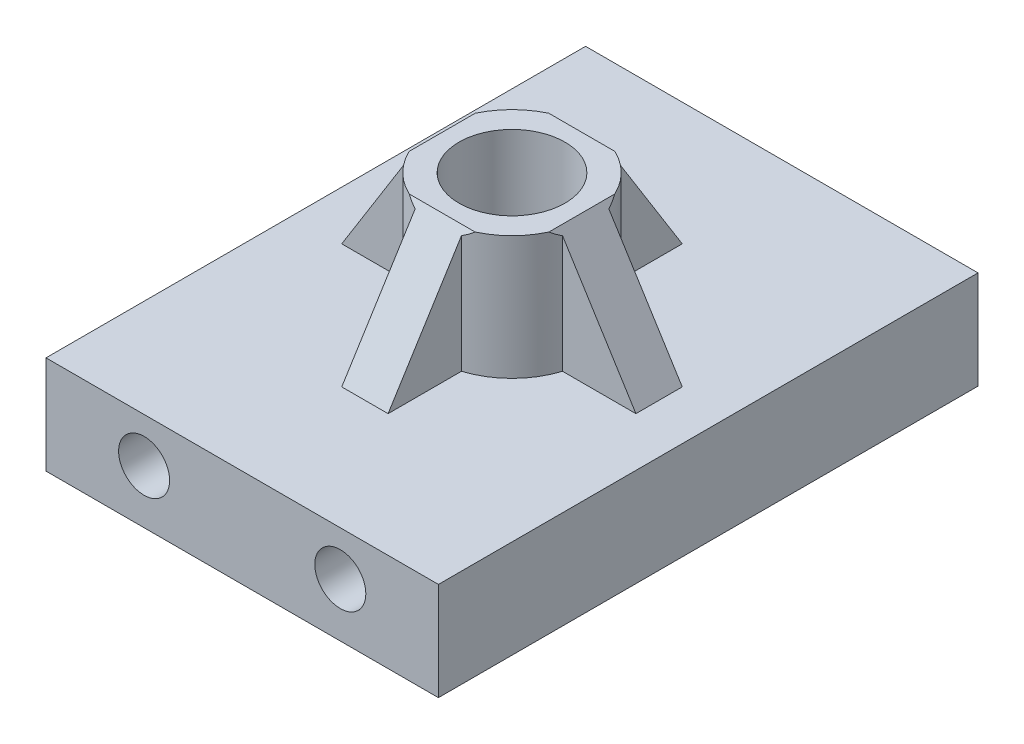
ISO-10303-21;
HEADER;
FILE_DESCRIPTION(('STEP AP214'),'2;1');
FILE_NAME('part.step','',(''),(''),'','','');
FILE_SCHEMA(('AUTOMOTIVE_DESIGN { 1 0 10303 214 1 1 1 1 }'));
ENDSEC;
DATA;
#1=APPLICATION_CONTEXT('core data for automotive mechanical design processes');
#2=APPLICATION_PROTOCOL_DEFINITION('international standard','automotive_design',2000,#1);
#3=PRODUCT_CONTEXT('',#1,'mechanical');
#4=PRODUCT('Part','Part','',(#3));
#5=PRODUCT_RELATED_PRODUCT_CATEGORY('part','',(#4));
#6=PRODUCT_DEFINITION_FORMATION('','',#4);
#7=PRODUCT_DEFINITION_CONTEXT('part definition',#1,'design');
#8=PRODUCT_DEFINITION('design','',#6,#7);
#9=PRODUCT_DEFINITION_SHAPE('','',#8);
#10=(LENGTH_UNIT() NAMED_UNIT(*) SI_UNIT(.MILLI.,.METRE.));
#11=(NAMED_UNIT(*) PLANE_ANGLE_UNIT() SI_UNIT($,.RADIAN.));
#12=(NAMED_UNIT(*) SI_UNIT($,.STERADIAN.) SOLID_ANGLE_UNIT());
#13=UNCERTAINTY_MEASURE_WITH_UNIT(LENGTH_MEASURE(1.E-05),#10,'distance_accuracy_value','');
#14=(GEOMETRIC_REPRESENTATION_CONTEXT(3) GLOBAL_UNCERTAINTY_ASSIGNED_CONTEXT((#13)) GLOBAL_UNIT_ASSIGNED_CONTEXT((#10,
#11,#12)) REPRESENTATION_CONTEXT('',''));
#15=CARTESIAN_POINT('',(0.,0.,0.));
#16=DIRECTION('',(0.,0.,1.));
#17=DIRECTION('',(1.,0.,0.));
#18=AXIS2_PLACEMENT_3D('',#15,#16,#17);
#19=CARTESIAN_POINT('',(0.,6.35,34.925));
#20=DIRECTION('',(0.,-1.,0.));
#21=DIRECTION('',(0.,0.,-1.));
#22=AXIS2_PLACEMENT_3D('',#19,#20,#21);
#23=PLANE('',#22);
#24=DIRECTION('',(-1.,0.,0.));
#25=VECTOR('',#24,1.);
#26=CARTESIAN_POINT('',(0.,6.35,0.));
#27=LINE('',#26,#25);
#28=CARTESIAN_POINT('',(25.4,6.35,0.));
#29=VERTEX_POINT('',#28);
#30=CARTESIAN_POINT('',(0.,6.35,0.));
#31=VERTEX_POINT('',#30);
#32=EDGE_CURVE('E402',#29,#31,#27,.T.);
#33=ORIENTED_EDGE('',*,*,#32,.T.);
#34=DIRECTION('',(0.,0.,-1.));
#35=VECTOR('',#34,1.);
#36=CARTESIAN_POINT('',(0.,6.35,34.925));
#37=LINE('',#36,#35);
#38=CARTESIAN_POINT('',(0.,6.35,34.925));
#39=VERTEX_POINT('',#38);
#40=EDGE_CURVE('E411',#39,#31,#37,.T.);
#41=ORIENTED_EDGE('',*,*,#40,.F.);
#42=DIRECTION('',(-1.,0.,0.));
#43=VECTOR('',#42,1.);
#44=CARTESIAN_POINT('',(0.,6.35,34.925));
#45=LINE('',#44,#43);
#46=CARTESIAN_POINT('',(25.4,6.35,34.925));
#47=VERTEX_POINT('',#46);
#48=EDGE_CURVE('E408',#47,#39,#45,.T.);
#49=ORIENTED_EDGE('',*,*,#48,.F.);
#50=DIRECTION('',(0.,0.,-1.));
#51=VECTOR('',#50,1.);
#52=CARTESIAN_POINT('',(25.4,6.35,34.925));
#53=LINE('',#52,#51);
#54=EDGE_CURVE('E426',#47,#29,#53,.T.);
#55=ORIENTED_EDGE('',*,*,#54,.T.);
#56=EDGE_LOOP('',(#33,#41,#49,#55));
#57=FACE_BOUND('',#56,.T.);
#58=DIRECTION('',(-1.,0.,0.));
#59=VECTOR('',#58,1.);
#60=CARTESIAN_POINT('',(23.4696960070847,6.35,15.9624999999999));
#61=LINE('',#60,#59);
#62=CARTESIAN_POINT('',(22.219957303266,6.35,15.9624999999999));
#63=VERTEX_POINT('',#62);
#64=CARTESIAN_POINT('',(17.4696960070847,6.35,15.9624999999999));
#65=VERTEX_POINT('',#64);
#66=EDGE_CURVE('E307',#63,#65,#61,.T.);
#67=ORIENTED_EDGE('',*,*,#66,.F.);
#68=DIRECTION('',(0.,0.,1.));
#69=VECTOR('',#68,1.);
#70=CARTESIAN_POINT('',(22.2199573032662,6.35,34.9249999999998));
#71=LINE('',#70,#69);
#72=CARTESIAN_POINT('',(22.219957303266,6.35,18.9624999999999));
#73=VERTEX_POINT('',#72);
#74=EDGE_CURVE('E11',#63,#73,#71,.T.);
#75=ORIENTED_EDGE('',*,*,#74,.T.);
#76=DIRECTION('',(1.,0.,0.));
#77=VECTOR('',#76,1.);
#78=CARTESIAN_POINT('',(23.4696960070847,6.35,18.9624999999999));
#79=LINE('',#78,#77);
#80=CARTESIAN_POINT('',(17.4696960070847,6.35,18.9625));
#81=VERTEX_POINT('',#80);
#82=EDGE_CURVE('E180',#81,#73,#79,.T.);
#83=ORIENTED_EDGE('',*,*,#82,.F.);
#84=CARTESIAN_POINT('',(12.7,6.35,17.4625));
#85=DIRECTION('',(0.,-1.,0.));
#86=DIRECTION('',(0.,0.,-1.));
#87=AXIS2_PLACEMENT_3D('',#84,#85,#86);
#88=CIRCLE('',#87,5.);
#89=CARTESIAN_POINT('',(14.2,6.35,22.2321960070847));
#90=VERTEX_POINT('',#89);
#91=EDGE_CURVE('E191',#90,#81,#88,.F.);
#92=ORIENTED_EDGE('',*,*,#91,.F.);
#93=DIRECTION('',(0.,0.,-1.));
#94=VECTOR('',#93,1.);
#95=CARTESIAN_POINT('',(14.2,6.35,28.2321960070847));
#96=LINE('',#95,#94);
#97=CARTESIAN_POINT('',(14.2,6.35,26.982457303266));
#98=VERTEX_POINT('',#97);
#99=EDGE_CURVE('E193',#98,#90,#96,.T.);
#100=ORIENTED_EDGE('',*,*,#99,.F.);
#101=DIRECTION('',(-1.,0.,0.));
#102=VECTOR('',#101,1.);
#103=CARTESIAN_POINT('',(0.,6.35,26.982457303266));
#104=LINE('',#103,#102);
#105=CARTESIAN_POINT('',(11.2,6.35,26.982457303266));
#106=VERTEX_POINT('',#105);
#107=EDGE_CURVE('E268',#98,#106,#104,.T.);
#108=ORIENTED_EDGE('',*,*,#107,.T.);
#109=DIRECTION('',(0.,0.,1.));
#110=VECTOR('',#109,1.);
#111=CARTESIAN_POINT('',(11.2,6.35,28.2321960070847));
#112=LINE('',#111,#110);
#113=CARTESIAN_POINT('',(11.2,6.35,22.2321960070847));
#114=VERTEX_POINT('',#113);
#115=EDGE_CURVE('E313',#114,#106,#112,.T.);
#116=ORIENTED_EDGE('',*,*,#115,.F.);
#117=CARTESIAN_POINT('',(7.93030399291528,6.35,18.9625));
#118=VERTEX_POINT('',#117);
#119=EDGE_CURVE('E200',#118,#114,#88,.F.);
#120=ORIENTED_EDGE('',*,*,#119,.F.);
#121=DIRECTION('',(1.,0.,0.));
#122=VECTOR('',#121,1.);
#123=CARTESIAN_POINT('',(1.93030399291528,6.35,18.9625));
#124=LINE('',#123,#122);
#125=CARTESIAN_POINT('',(3.18004269673398,6.35,18.9625));
#126=VERTEX_POINT('',#125);
#127=EDGE_CURVE('E317',#126,#118,#124,.T.);
#128=ORIENTED_EDGE('',*,*,#127,.F.);
#129=DIRECTION('',(0.,0.,-1.));
#130=VECTOR('',#129,1.);
#131=CARTESIAN_POINT('',(3.18004269673403,6.35,34.925));
#132=LINE('',#131,#130);
#133=CARTESIAN_POINT('',(3.18004269673397,6.35,15.9625));
#134=VERTEX_POINT('',#133);
#135=EDGE_CURVE('E249',#126,#134,#132,.T.);
#136=ORIENTED_EDGE('',*,*,#135,.T.);
#137=DIRECTION('',(-1.,0.,0.));
#138=VECTOR('',#137,1.);
#139=CARTESIAN_POINT('',(1.93030399291527,6.35,15.9625));
#140=LINE('',#139,#138);
#141=CARTESIAN_POINT('',(7.93030399291526,6.35,15.9625));
#142=VERTEX_POINT('',#141);
#143=EDGE_CURVE('E325',#142,#134,#140,.T.);
#144=ORIENTED_EDGE('',*,*,#143,.F.);
#145=CARTESIAN_POINT('',(11.2,6.35,12.6928039929153));
#146=VERTEX_POINT('',#145);
#147=EDGE_CURVE('E206',#146,#142,#88,.F.);
#148=ORIENTED_EDGE('',*,*,#147,.F.);
#149=DIRECTION('',(0.,0.,1.));
#150=VECTOR('',#149,1.);
#151=CARTESIAN_POINT('',(11.2,6.35,6.69280399291527));
#152=LINE('',#151,#150);
#153=CARTESIAN_POINT('',(11.2,6.35,7.94254269673397));
#154=VERTEX_POINT('',#153);
#155=EDGE_CURVE('E329',#154,#146,#152,.T.);
#156=ORIENTED_EDGE('',*,*,#155,.F.);
#157=DIRECTION('',(1.,0.,0.));
#158=VECTOR('',#157,1.);
#159=CARTESIAN_POINT('',(0.,6.35,7.94254269673397));
#160=LINE('',#159,#158);
#161=CARTESIAN_POINT('',(14.2,6.35,7.94254269673397));
#162=VERTEX_POINT('',#161);
#163=EDGE_CURVE('E230',#154,#162,#160,.T.);
#164=ORIENTED_EDGE('',*,*,#163,.T.);
#165=DIRECTION('',(0.,0.,-1.));
#166=VECTOR('',#165,1.);
#167=CARTESIAN_POINT('',(14.2,6.35,6.69280399291527));
#168=LINE('',#167,#166);
#169=CARTESIAN_POINT('',(14.2,6.35,12.6928039929153));
#170=VERTEX_POINT('',#169);
#171=EDGE_CURVE('E339',#170,#162,#168,.T.);
#172=ORIENTED_EDGE('',*,*,#171,.F.);
#173=EDGE_CURVE('E201',#65,#170,#88,.F.);
#174=ORIENTED_EDGE('',*,*,#173,.F.);
#175=EDGE_LOOP('',(#67,#75,#83,#92,#100,#108,#116,#120,#128,#136,#144,#148,#156,#164,#172,#174));
#176=FACE_BOUND('',#175,.T.);
#177=ADVANCED_FACE('F45',(#57,#176),#23,.F.);
#178=CARTESIAN_POINT('',(12.7,14.35,17.4625));
#179=DIRECTION('',(0.,-1.,0.));
#180=DIRECTION('',(0.,0.,-1.));
#181=AXIS2_PLACEMENT_3D('',#178,#179,#180);
#182=CYLINDRICAL_SURFACE('',#181,5.);
#183=CARTESIAN_POINT('',(12.7,14.35,17.4625));
#184=DIRECTION('',(0.,1.,0.));
#185=DIRECTION('',(0.,0.,1.));
#186=AXIS2_PLACEMENT_3D('',#183,#184,#185);
#187=CIRCLE('',#186,5.);
#188=CARTESIAN_POINT('',(17.2210024879913,14.35,15.3269587328791));
#189=VERTEX_POINT('',#188);
#190=CARTESIAN_POINT('',(14.8355412671209,14.35,12.9414975120087));
#191=VERTEX_POINT('',#190);
#192=EDGE_CURVE('E297',#189,#191,#187,.T.);
#193=ORIENTED_EDGE('',*,*,#192,.F.);
#194=CARTESIAN_POINT('',(12.7,21.5851163874129,17.4625));
#195=DIRECTION('',(0.848048096156423,0.52991926423321,0.));
#196=DIRECTION('',(0.52991926423321,-0.848048096156423,0.));
#197=AXIS2_PLACEMENT_3D('',#194,#195,#196);
#198=ELLIPSE('',#197,9.4353995739992,5.);
#199=CARTESIAN_POINT('',(17.4696960070847,13.9520071742461,15.9624999999999));
#200=VERTEX_POINT('',#199);
#201=EDGE_CURVE('E275',#189,#200,#198,.F.);
#202=ORIENTED_EDGE('',*,*,#201,.T.);
#203=DIRECTION('',(0.,-1.,0.));
#204=VECTOR('',#203,1.);
#205=CARTESIAN_POINT('',(17.4696960070847,21.0582039324994,15.9624999999999));
#206=LINE('',#205,#204);
#207=EDGE_CURVE('E187',#200,#65,#206,.T.);
#208=ORIENTED_EDGE('',*,*,#207,.T.);
#209=ORIENTED_EDGE('',*,*,#173,.T.);
#210=DIRECTION('',(0.,-1.,0.));
#211=VECTOR('',#210,1.);
#212=CARTESIAN_POINT('',(14.2,21.0582039324994,12.6928039929153));
#213=LINE('',#212,#211);
#214=CARTESIAN_POINT('',(14.2,13.9520071742461,12.6928039929153));
#215=VERTEX_POINT('',#214);
#216=EDGE_CURVE('E344',#215,#170,#213,.T.);
#217=ORIENTED_EDGE('',*,*,#216,.F.);
#218=CARTESIAN_POINT('',(12.7,21.5851163874129,17.4625));
#219=DIRECTION('',(0.,0.52991926423321,-0.848048096156423));
#220=DIRECTION('',(0.,-0.848048096156423,-0.52991926423321));
#221=AXIS2_PLACEMENT_3D('',#218,#219,#220);
#222=ELLIPSE('',#221,9.43539957399919,5.);
#223=EDGE_CURVE('E217',#215,#191,#222,.F.);
#224=ORIENTED_EDGE('',*,*,#223,.T.);
#225=EDGE_LOOP('',(#193,#202,#208,#209,#217,#224));
#226=FACE_BOUND('',#225,.T.);
#227=ADVANCED_FACE('F303',(#226),#182,.T.);
#228=DIRECTION('',(0.,-1.,0.));
#229=VECTOR('',#228,1.);
#230=CARTESIAN_POINT('',(17.4696960070847,21.0582039324994,18.9625));
#231=LINE('',#230,#229);
#232=CARTESIAN_POINT('',(17.4696960070847,13.9520071742461,18.9625));
#233=VERTEX_POINT('',#232);
#234=EDGE_CURVE('E178',#233,#81,#231,.T.);
#235=ORIENTED_EDGE('',*,*,#234,.F.);
#236=CARTESIAN_POINT('',(12.7,21.5851163874129,17.4625));
#237=DIRECTION('',(0.848048096156423,0.52991926423321,0.));
#238=DIRECTION('',(0.52991926423321,-0.848048096156423,0.));
#239=AXIS2_PLACEMENT_3D('',#236,#237,#238);
#240=ELLIPSE('',#239,9.4353995739992,5.);
#241=CARTESIAN_POINT('',(17.2210024879914,14.35,19.5980412671208));
#242=VERTEX_POINT('',#241);
#243=EDGE_CURVE('E56',#233,#242,#240,.F.);
#244=ORIENTED_EDGE('',*,*,#243,.T.);
#245=CARTESIAN_POINT('',(14.8355412671209,14.35,21.9835024879913));
#246=VERTEX_POINT('',#245);
#247=EDGE_CURVE('E286',#246,#242,#187,.T.);
#248=ORIENTED_EDGE('',*,*,#247,.F.);
#249=CARTESIAN_POINT('',(12.7,21.5851163874129,17.4625));
#250=DIRECTION('',(0.,0.52991926423321,0.848048096156423));
#251=DIRECTION('',(0.,-0.848048096156423,0.52991926423321));
#252=AXIS2_PLACEMENT_3D('',#249,#250,#251);
#253=ELLIPSE('',#252,9.43539957399919,5.);
#254=CARTESIAN_POINT('',(14.2,13.9520071742461,22.2321960070847));
#255=VERTEX_POINT('',#254);
#256=EDGE_CURVE('E256',#246,#255,#253,.F.);
#257=ORIENTED_EDGE('',*,*,#256,.T.);
#258=DIRECTION('',(0.,-1.,0.));
#259=VECTOR('',#258,1.);
#260=CARTESIAN_POINT('',(14.2,21.0582039324994,22.2321960070847));
#261=LINE('',#260,#259);
#262=EDGE_CURVE('E198',#255,#90,#261,.T.);
#263=ORIENTED_EDGE('',*,*,#262,.T.);
#264=ORIENTED_EDGE('',*,*,#91,.T.);
#265=EDGE_LOOP('',(#235,#244,#248,#257,#263,#264));
#266=FACE_BOUND('',#265,.T.);
#267=ADVANCED_FACE('F196',(#266),#182,.T.);
#268=DIRECTION('',(0.,-1.,0.));
#269=VECTOR('',#268,1.);
#270=CARTESIAN_POINT('',(11.2,21.0582039324994,22.2321960070847));
#271=LINE('',#270,#269);
#272=CARTESIAN_POINT('',(11.2,13.9520071742461,22.2321960070847));
#273=VERTEX_POINT('',#272);
#274=EDGE_CURVE('E318',#273,#114,#271,.T.);
#275=ORIENTED_EDGE('',*,*,#274,.F.);
#276=CARTESIAN_POINT('',(12.7,21.5851163874129,17.4625));
#277=DIRECTION('',(0.,0.52991926423321,0.848048096156423));
#278=DIRECTION('',(0.,-0.848048096156423,0.52991926423321));
#279=AXIS2_PLACEMENT_3D('',#276,#277,#278);
#280=ELLIPSE('',#279,9.43539957399919,5.);
#281=CARTESIAN_POINT('',(10.5644587328791,14.35,21.9835024879913));
#282=VERTEX_POINT('',#281);
#283=EDGE_CURVE('E265',#273,#282,#280,.F.);
#284=ORIENTED_EDGE('',*,*,#283,.T.);
#285=CARTESIAN_POINT('',(8.17899751200867,14.35,19.5980412671209));
#286=VERTEX_POINT('',#285);
#287=EDGE_CURVE('E296',#286,#282,#187,.T.);
#288=ORIENTED_EDGE('',*,*,#287,.F.);
#289=CARTESIAN_POINT('',(12.7,21.5851163874129,17.4625));
#290=DIRECTION('',(-0.848048096156423,0.52991926423321,0.));
#291=DIRECTION('',(-0.52991926423321,-0.848048096156423,0.));
#292=AXIS2_PLACEMENT_3D('',#289,#290,#291);
#293=ELLIPSE('',#292,9.43539957399919,5.);
#294=CARTESIAN_POINT('',(7.93030399291528,13.9520071742461,18.9625));
#295=VERTEX_POINT('',#294);
#296=EDGE_CURVE('E237',#286,#295,#293,.F.);
#297=ORIENTED_EDGE('',*,*,#296,.T.);
#298=DIRECTION('',(0.,-1.,0.));
#299=VECTOR('',#298,1.);
#300=CARTESIAN_POINT('',(7.93030399291528,21.0582039324994,18.9625));
#301=LINE('',#300,#299);
#302=EDGE_CURVE('E333',#295,#118,#301,.T.);
#303=ORIENTED_EDGE('',*,*,#302,.T.);
#304=ORIENTED_EDGE('',*,*,#119,.T.);
#305=EDGE_LOOP('',(#275,#284,#288,#297,#303,#304));
#306=FACE_BOUND('',#305,.T.);
#307=ADVANCED_FACE('F517',(#306),#182,.T.);
#308=DIRECTION('',(0.,-1.,0.));
#309=VECTOR('',#308,1.);
#310=CARTESIAN_POINT('',(7.93030399291526,21.0582039324994,15.9625));
#311=LINE('',#310,#309);
#312=CARTESIAN_POINT('',(7.93030399291526,13.9520071742461,15.9625));
#313=VERTEX_POINT('',#312);
#314=EDGE_CURVE('E330',#313,#142,#311,.T.);
#315=ORIENTED_EDGE('',*,*,#314,.F.);
#316=CARTESIAN_POINT('',(12.7,21.5851163874129,17.4625));
#317=DIRECTION('',(-0.848048096156423,0.52991926423321,0.));
#318=DIRECTION('',(-0.52991926423321,-0.848048096156423,0.));
#319=AXIS2_PLACEMENT_3D('',#316,#317,#318);
#320=ELLIPSE('',#319,9.43539957399919,5.);
#321=CARTESIAN_POINT('',(8.17899751200866,14.35,15.3269587328792));
#322=VERTEX_POINT('',#321);
#323=EDGE_CURVE('E246',#313,#322,#320,.F.);
#324=ORIENTED_EDGE('',*,*,#323,.T.);
#325=CARTESIAN_POINT('',(10.5644587328791,14.35,12.9414975120087));
#326=VERTEX_POINT('',#325);
#327=EDGE_CURVE('E356',#326,#322,#187,.T.);
#328=ORIENTED_EDGE('',*,*,#327,.F.);
#329=CARTESIAN_POINT('',(12.7,21.5851163874129,17.4625));
#330=DIRECTION('',(0.,0.52991926423321,-0.848048096156423));
#331=DIRECTION('',(0.,-0.848048096156423,-0.52991926423321));
#332=AXIS2_PLACEMENT_3D('',#329,#330,#331);
#333=ELLIPSE('',#332,9.43539957399919,5.);
#334=CARTESIAN_POINT('',(11.2,13.9520071742461,12.6928039929153));
#335=VERTEX_POINT('',#334);
#336=EDGE_CURVE('E221',#326,#335,#333,.F.);
#337=ORIENTED_EDGE('',*,*,#336,.T.);
#338=DIRECTION('',(0.,-1.,0.));
#339=VECTOR('',#338,1.);
#340=CARTESIAN_POINT('',(11.2,21.0582039324994,12.6928039929153));
#341=LINE('',#340,#339);
#342=EDGE_CURVE('E347',#335,#146,#341,.T.);
#343=ORIENTED_EDGE('',*,*,#342,.T.);
#344=ORIENTED_EDGE('',*,*,#147,.T.);
#345=EDGE_LOOP('',(#315,#324,#328,#337,#343,#344));
#346=FACE_BOUND('',#345,.T.);
#347=ADVANCED_FACE('F477',(#346),#182,.T.);
#348=CARTESIAN_POINT('',(0.,0.,34.925));
#349=DIRECTION('',(1.,0.,0.));
#350=DIRECTION('',(0.,0.,-1.));
#351=AXIS2_PLACEMENT_3D('',#348,#349,#350);
#352=PLANE('',#351);
#353=DIRECTION('',(0.,-1.,0.));
#354=VECTOR('',#353,1.);
#355=CARTESIAN_POINT('',(0.,0.,0.));
#356=LINE('',#355,#354);
#357=CARTESIAN_POINT('',(0.,0.,0.));
#358=VERTEX_POINT('',#357);
#359=EDGE_CURVE('E385',#31,#358,#356,.T.);
#360=ORIENTED_EDGE('',*,*,#359,.T.);
#361=DIRECTION('',(0.,0.,-1.));
#362=VECTOR('',#361,1.);
#363=CARTESIAN_POINT('',(0.,0.,34.925));
#364=LINE('',#363,#362);
#365=CARTESIAN_POINT('',(0.,0.,34.925));
#366=VERTEX_POINT('',#365);
#367=EDGE_CURVE('E207',#366,#358,#364,.T.);
#368=ORIENTED_EDGE('',*,*,#367,.F.);
#369=DIRECTION('',(0.,-1.,0.));
#370=VECTOR('',#369,1.);
#371=CARTESIAN_POINT('',(0.,0.,34.925));
#372=LINE('',#371,#370);
#373=EDGE_CURVE('E397',#39,#366,#372,.T.);
#374=ORIENTED_EDGE('',*,*,#373,.F.);
#375=ORIENTED_EDGE('',*,*,#40,.T.);
#376=EDGE_LOOP('',(#360,#368,#374,#375));
#377=FACE_BOUND('',#376,.T.);
#378=ADVANCED_FACE('F444',(#377),#352,.F.);
#379=CARTESIAN_POINT('',(0.,0.,34.925));
#380=DIRECTION('',(0.,1.,0.));
#381=DIRECTION('',(0.,0.,1.));
#382=AXIS2_PLACEMENT_3D('',#379,#380,#381);
#383=PLANE('',#382);
#384=CARTESIAN_POINT('',(12.7,0.,17.4625));
#385=DIRECTION('',(0.,1.,0.));
#386=DIRECTION('',(0.,0.,1.));
#387=AXIS2_PLACEMENT_3D('',#384,#385,#386);
#388=CIRCLE('',#387,3.429);
#389=CARTESIAN_POINT('',(12.7,0.,20.8915));
#390=VERTEX_POINT('',#389);
#391=EDGE_CURVE('E360',#390,#390,#388,.T.);
#392=ORIENTED_EDGE('',*,*,#391,.T.);
#393=EDGE_LOOP('',(#392));
#394=FACE_BOUND('',#393,.T.);
#395=DIRECTION('',(1.,0.,0.));
#396=VECTOR('',#395,1.);
#397=CARTESIAN_POINT('',(0.,0.,0.));
#398=LINE('',#397,#396);
#399=CARTESIAN_POINT('',(25.4,0.,0.));
#400=VERTEX_POINT('',#399);
#401=EDGE_CURVE('E415',#358,#400,#398,.T.);
#402=ORIENTED_EDGE('',*,*,#401,.T.);
#403=DIRECTION('',(0.,0.,-1.));
#404=VECTOR('',#403,1.);
#405=CARTESIAN_POINT('',(25.4,0.,34.925));
#406=LINE('',#405,#404);
#407=CARTESIAN_POINT('',(25.4,0.,34.925));
#408=VERTEX_POINT('',#407);
#409=EDGE_CURVE('E429',#408,#400,#406,.T.);
#410=ORIENTED_EDGE('',*,*,#409,.F.);
#411=DIRECTION('',(1.,0.,0.));
#412=VECTOR('',#411,1.);
#413=CARTESIAN_POINT('',(0.,0.,34.925));
#414=LINE('',#413,#412);
#415=EDGE_CURVE('E401',#366,#408,#414,.T.);
#416=ORIENTED_EDGE('',*,*,#415,.F.);
#417=ORIENTED_EDGE('',*,*,#367,.T.);
#418=EDGE_LOOP('',(#402,#410,#416,#417));
#419=FACE_BOUND('',#418,.T.);
#420=ADVANCED_FACE('F440',(#394,#419),#383,.F.);
#421=CARTESIAN_POINT('',(25.4,0.,34.925));
#422=DIRECTION('',(-1.,0.,0.));
#423=DIRECTION('',(0.,0.,1.));
#424=AXIS2_PLACEMENT_3D('',#421,#422,#423);
#425=PLANE('',#424);
#426=DIRECTION('',(0.,1.,0.));
#427=VECTOR('',#426,1.);
#428=CARTESIAN_POINT('',(25.4,0.,0.));
#429=LINE('',#428,#427);
#430=EDGE_CURVE('E418',#400,#29,#429,.T.);
#431=ORIENTED_EDGE('',*,*,#430,.T.);
#432=ORIENTED_EDGE('',*,*,#54,.F.);
#433=DIRECTION('',(0.,1.,0.));
#434=VECTOR('',#433,1.);
#435=CARTESIAN_POINT('',(25.4,0.,34.925));
#436=LINE('',#435,#434);
#437=EDGE_CURVE('E405',#408,#47,#436,.T.);
#438=ORIENTED_EDGE('',*,*,#437,.F.);
#439=ORIENTED_EDGE('',*,*,#409,.T.);
#440=EDGE_LOOP('',(#431,#432,#438,#439));
#441=FACE_BOUND('',#440,.T.);
#442=ADVANCED_FACE('F450',(#441),#425,.F.);
#443=CARTESIAN_POINT('',(0.,0.,34.925));
#444=DIRECTION('',(0.,0.,-1.));
#445=DIRECTION('',(-1.,0.,0.));
#446=AXIS2_PLACEMENT_3D('',#443,#444,#445);
#447=PLANE('',#446);
#448=CARTESIAN_POINT('',(6.35,3.47207993233841,34.925));
#449=DIRECTION('',(0.,0.,1.));
#450=DIRECTION('',(1.,0.,0.));
#451=AXIS2_PLACEMENT_3D('',#448,#449,#450);
#452=CIRCLE('',#451,1.651);
#453=CARTESIAN_POINT('',(8.001,3.47207993233841,34.925));
#454=VERTEX_POINT('',#453);
#455=EDGE_CURVE('E386',#454,#454,#452,.T.);
#456=ORIENTED_EDGE('',*,*,#455,.F.);
#457=EDGE_LOOP('',(#456));
#458=FACE_BOUND('',#457,.T.);
#459=CARTESIAN_POINT('',(19.05,3.47207993233841,34.925));
#460=DIRECTION('',(0.,0.,1.));
#461=DIRECTION('',(1.,0.,0.));
#462=AXIS2_PLACEMENT_3D('',#459,#460,#461);
#463=CIRCLE('',#462,1.651);
#464=CARTESIAN_POINT('',(20.701,3.47207993233841,34.925));
#465=VERTEX_POINT('',#464);
#466=EDGE_CURVE('E390',#465,#465,#463,.T.);
#467=ORIENTED_EDGE('',*,*,#466,.F.);
#468=EDGE_LOOP('',(#467));
#469=FACE_BOUND('',#468,.T.);
#470=ORIENTED_EDGE('',*,*,#373,.T.);
#471=ORIENTED_EDGE('',*,*,#415,.T.);
#472=ORIENTED_EDGE('',*,*,#437,.T.);
#473=ORIENTED_EDGE('',*,*,#48,.T.);
#474=EDGE_LOOP('',(#470,#471,#472,#473));
#475=FACE_BOUND('',#474,.T.);
#476=ADVANCED_FACE('F454',(#458,#469,#475),#447,.F.);
#477=CARTESIAN_POINT('',(0.,0.,0.));
#478=DIRECTION('',(0.,0.,-1.));
#479=DIRECTION('',(-1.,0.,0.));
#480=AXIS2_PLACEMENT_3D('',#477,#478,#479);
#481=PLANE('',#480);
#482=CARTESIAN_POINT('',(6.35,3.47207993233841,0.));
#483=DIRECTION('',(0.,0.,1.));
#484=DIRECTION('',(1.,0.,0.));
#485=AXIS2_PLACEMENT_3D('',#482,#483,#484);
#486=CIRCLE('',#485,1.651);
#487=CARTESIAN_POINT('',(8.001,3.47207993233841,0.));
#488=VERTEX_POINT('',#487);
#489=EDGE_CURVE('E370',#488,#488,#486,.T.);
#490=ORIENTED_EDGE('',*,*,#489,.T.);
#491=EDGE_LOOP('',(#490));
#492=FACE_BOUND('',#491,.T.);
#493=CARTESIAN_POINT('',(19.05,3.47207993233841,0.));
#494=DIRECTION('',(0.,0.,1.));
#495=DIRECTION('',(1.,0.,0.));
#496=AXIS2_PLACEMENT_3D('',#493,#494,#495);
#497=CIRCLE('',#496,1.651);
#498=CARTESIAN_POINT('',(20.701,3.47207993233841,0.));
#499=VERTEX_POINT('',#498);
#500=EDGE_CURVE('E364',#499,#499,#497,.T.);
#501=ORIENTED_EDGE('',*,*,#500,.T.);
#502=EDGE_LOOP('',(#501));
#503=FACE_BOUND('',#502,.T.);
#504=ORIENTED_EDGE('',*,*,#359,.F.);
#505=ORIENTED_EDGE('',*,*,#32,.F.);
#506=ORIENTED_EDGE('',*,*,#430,.F.);
#507=ORIENTED_EDGE('',*,*,#401,.F.);
#508=EDGE_LOOP('',(#504,#505,#506,#507));
#509=FACE_BOUND('',#508,.T.);
#510=ADVANCED_FACE('F448',(#492,#503,#509),#481,.T.);
#511=CARTESIAN_POINT('',(19.05,3.47207993233841,19.925));
#512=DIRECTION('',(0.,0.,1.));
#513=DIRECTION('',(1.,0.,0.));
#514=AXIS2_PLACEMENT_3D('',#511,#512,#513);
#515=CYLINDRICAL_SURFACE('',#514,1.651);
#516=CARTESIAN_POINT('',(19.05,3.47207993233841,19.925));
#517=DIRECTION('',(0.,0.,1.));
#518=DIRECTION('',(1.,0.,0.));
#519=AXIS2_PLACEMENT_3D('',#516,#517,#518);
#520=CIRCLE('',#519,1.651);
#521=CARTESIAN_POINT('',(20.701,3.47207993233841,19.925));
#522=VERTEX_POINT('',#521);
#523=EDGE_CURVE('E369',#522,#522,#520,.T.);
#524=ORIENTED_EDGE('',*,*,#523,.F.);
#525=EDGE_LOOP('',(#524));
#526=FACE_BOUND('',#525,.T.);
#527=ORIENTED_EDGE('',*,*,#466,.T.);
#528=EDGE_LOOP('',(#527));
#529=FACE_BOUND('',#528,.T.);
#530=ADVANCED_FACE('F462',(#526,#529),#515,.F.);
#531=CARTESIAN_POINT('',(19.05,3.47207993233841,19.925));
#532=DIRECTION('',(0.,0.,1.));
#533=DIRECTION('',(1.,0.,0.));
#534=AXIS2_PLACEMENT_3D('',#531,#532,#533);
#535=PLANE('',#534);
#536=ORIENTED_EDGE('',*,*,#523,.T.);
#537=EDGE_LOOP('',(#536));
#538=FACE_BOUND('',#537,.T.);
#539=ADVANCED_FACE('F576',(#538),#535,.T.);
#540=CARTESIAN_POINT('',(6.35,3.47207993233841,19.925));
#541=DIRECTION('',(0.,0.,1.));
#542=DIRECTION('',(1.,0.,0.));
#543=AXIS2_PLACEMENT_3D('',#540,#541,#542);
#544=CYLINDRICAL_SURFACE('',#543,1.651);
#545=CARTESIAN_POINT('',(6.35,3.47207993233841,19.925));
#546=DIRECTION('',(0.,0.,1.));
#547=DIRECTION('',(1.,0.,0.));
#548=AXIS2_PLACEMENT_3D('',#545,#546,#547);
#549=CIRCLE('',#548,1.651);
#550=CARTESIAN_POINT('',(8.001,3.47207993233841,19.925));
#551=VERTEX_POINT('',#550);
#552=EDGE_CURVE('E381',#551,#551,#549,.T.);
#553=ORIENTED_EDGE('',*,*,#552,.F.);
#554=EDGE_LOOP('',(#553));
#555=FACE_BOUND('',#554,.T.);
#556=ORIENTED_EDGE('',*,*,#455,.T.);
#557=EDGE_LOOP('',(#556));
#558=FACE_BOUND('',#557,.T.);
#559=ADVANCED_FACE('F572',(#555,#558),#544,.F.);
#560=CARTESIAN_POINT('',(6.35,3.47207993233841,19.925));
#561=DIRECTION('',(0.,0.,1.));
#562=DIRECTION('',(1.,0.,0.));
#563=AXIS2_PLACEMENT_3D('',#560,#561,#562);
#564=PLANE('',#563);
#565=ORIENTED_EDGE('',*,*,#552,.T.);
#566=EDGE_LOOP('',(#565));
#567=FACE_BOUND('',#566,.T.);
#568=ADVANCED_FACE('F568',(#567),#564,.T.);
#569=CARTESIAN_POINT('',(19.05,3.47207993233841,15.));
#570=DIRECTION('',(0.,0.,-1.));
#571=DIRECTION('',(-1.,0.,0.));
#572=AXIS2_PLACEMENT_3D('',#569,#570,#571);
#573=CYLINDRICAL_SURFACE('',#572,1.651);
#574=CARTESIAN_POINT('',(19.05,3.47207993233841,15.));
#575=DIRECTION('',(0.,0.,1.));
#576=DIRECTION('',(1.,0.,0.));
#577=AXIS2_PLACEMENT_3D('',#574,#575,#576);
#578=CIRCLE('',#577,1.651);
#579=CARTESIAN_POINT('',(20.701,3.47207993233841,15.));
#580=VERTEX_POINT('',#579);
#581=EDGE_CURVE('E374',#580,#580,#578,.T.);
#582=ORIENTED_EDGE('',*,*,#581,.T.);
#583=EDGE_LOOP('',(#582));
#584=FACE_BOUND('',#583,.T.);
#585=ORIENTED_EDGE('',*,*,#500,.F.);
#586=EDGE_LOOP('',(#585));
#587=FACE_BOUND('',#586,.T.);
#588=ADVANCED_FACE('F564',(#584,#587),#573,.F.);
#589=CARTESIAN_POINT('',(19.05,3.47207993233841,15.));
#590=DIRECTION('',(0.,0.,-1.));
#591=DIRECTION('',(1.,0.,0.));
#592=AXIS2_PLACEMENT_3D('',#589,#590,#591);
#593=PLANE('',#592);
#594=ORIENTED_EDGE('',*,*,#581,.F.);
#595=EDGE_LOOP('',(#594));
#596=FACE_BOUND('',#595,.T.);
#597=ADVANCED_FACE('F560',(#596),#593,.T.);
#598=CARTESIAN_POINT('',(6.35,3.47207993233841,15.));
#599=DIRECTION('',(0.,0.,-1.));
#600=DIRECTION('',(-1.,0.,0.));
#601=AXIS2_PLACEMENT_3D('',#598,#599,#600);
#602=CYLINDRICAL_SURFACE('',#601,1.651);
#603=CARTESIAN_POINT('',(6.35,3.47207993233841,15.));
#604=DIRECTION('',(0.,0.,1.));
#605=DIRECTION('',(1.,0.,0.));
#606=AXIS2_PLACEMENT_3D('',#603,#604,#605);
#607=CIRCLE('',#606,1.651);
#608=CARTESIAN_POINT('',(8.001,3.47207993233841,15.));
#609=VERTEX_POINT('',#608);
#610=EDGE_CURVE('E365',#609,#609,#607,.T.);
#611=ORIENTED_EDGE('',*,*,#610,.T.);
#612=EDGE_LOOP('',(#611));
#613=FACE_BOUND('',#612,.T.);
#614=ORIENTED_EDGE('',*,*,#489,.F.);
#615=EDGE_LOOP('',(#614));
#616=FACE_BOUND('',#615,.T.);
#617=ADVANCED_FACE('F556',(#613,#616),#602,.F.);
#618=CARTESIAN_POINT('',(6.35,3.47207993233841,15.));
#619=DIRECTION('',(0.,0.,-1.));
#620=DIRECTION('',(1.,0.,0.));
#621=AXIS2_PLACEMENT_3D('',#618,#619,#620);
#622=PLANE('',#621);
#623=ORIENTED_EDGE('',*,*,#610,.F.);
#624=EDGE_LOOP('',(#623));
#625=FACE_BOUND('',#624,.T.);
#626=ADVANCED_FACE('F552',(#625),#622,.T.);
#627=CARTESIAN_POINT('',(12.7,0.,17.4625));
#628=DIRECTION('',(0.,1.,0.));
#629=DIRECTION('',(0.,0.,1.));
#630=AXIS2_PLACEMENT_3D('',#627,#628,#629);
#631=CYLINDRICAL_SURFACE('',#630,3.429);
#632=ORIENTED_EDGE('',*,*,#391,.F.);
#633=EDGE_LOOP('',(#632));
#634=FACE_BOUND('',#633,.T.);
#635=CARTESIAN_POINT('',(12.7,14.35,17.4625));
#636=DIRECTION('',(0.,1.,0.));
#637=DIRECTION('',(0.,0.,1.));
#638=AXIS2_PLACEMENT_3D('',#635,#636,#637);
#639=CIRCLE('',#638,3.429);
#640=CARTESIAN_POINT('',(12.7,14.35,20.8915));
#641=VERTEX_POINT('',#640);
#642=EDGE_CURVE('E343',#641,#641,#639,.T.);
#643=ORIENTED_EDGE('',*,*,#642,.T.);
#644=EDGE_LOOP('',(#643));
#645=FACE_BOUND('',#644,.T.);
#646=ADVANCED_FACE('F548',(#634,#645),#631,.F.);
#647=CARTESIAN_POINT('',(12.7,14.35,17.4625));
#648=DIRECTION('',(0.,1.,0.));
#649=DIRECTION('',(0.,0.,1.));
#650=AXIS2_PLACEMENT_3D('',#647,#648,#649);
#651=PLANE('',#650);
#652=ORIENTED_EDGE('',*,*,#247,.T.);
#653=DIRECTION('',(0.,0.,-1.));
#654=VECTOR('',#653,1.);
#655=CARTESIAN_POINT('',(17.2210024879913,14.35,15.9625));
#656=LINE('',#655,#654);
#657=EDGE_CURVE('E271',#242,#189,#656,.T.);
#658=ORIENTED_EDGE('',*,*,#657,.T.);
#659=ORIENTED_EDGE('',*,*,#192,.T.);
#660=DIRECTION('',(-1.,0.,0.));
#661=VECTOR('',#660,1.);
#662=CARTESIAN_POINT('',(11.2,14.35,12.9414975120087));
#663=LINE('',#662,#661);
#664=EDGE_CURVE('E212',#191,#326,#663,.T.);
#665=ORIENTED_EDGE('',*,*,#664,.T.);
#666=ORIENTED_EDGE('',*,*,#327,.T.);
#667=DIRECTION('',(0.,0.,1.));
#668=VECTOR('',#667,1.);
#669=CARTESIAN_POINT('',(8.17899751200867,14.35,18.9625));
#670=LINE('',#669,#668);
#671=EDGE_CURVE('E233',#322,#286,#670,.T.);
#672=ORIENTED_EDGE('',*,*,#671,.T.);
#673=ORIENTED_EDGE('',*,*,#287,.T.);
#674=DIRECTION('',(1.,0.,0.));
#675=VECTOR('',#674,1.);
#676=CARTESIAN_POINT('',(14.2,14.35,21.9835024879913));
#677=LINE('',#676,#675);
#678=EDGE_CURVE('E252',#282,#246,#677,.T.);
#679=ORIENTED_EDGE('',*,*,#678,.T.);
#680=EDGE_LOOP('',(#652,#658,#659,#665,#666,#672,#673,#679));
#681=FACE_BOUND('',#680,.T.);
#682=ORIENTED_EDGE('',*,*,#642,.F.);
#683=EDGE_LOOP('',(#682));
#684=FACE_BOUND('',#683,.T.);
#685=ADVANCED_FACE('F290',(#681,#684),#651,.T.);
#686=CARTESIAN_POINT('',(11.2,21.0582039324994,6.69280399291527));
#687=DIRECTION('',(1.,0.,0.));
#688=DIRECTION('',(0.,0.,-1.));
#689=AXIS2_PLACEMENT_3D('',#686,#687,#688);
#690=PLANE('',#689);
#691=ORIENTED_EDGE('',*,*,#342,.F.);
#692=DIRECTION('',(0.,-0.848048096156423,-0.52991926423321));
#693=VECTOR('',#692,1.);
#694=CARTESIAN_POINT('',(11.2,14.35,12.9414975120087));
#695=LINE('',#694,#693);
#696=EDGE_CURVE('E224',#335,#154,#695,.T.);
#697=ORIENTED_EDGE('',*,*,#696,.T.);
#698=ORIENTED_EDGE('',*,*,#155,.T.);
#699=EDGE_LOOP('',(#691,#697,#698));
#700=FACE_BOUND('',#699,.T.);
#701=ADVANCED_FACE('F542',(#700),#690,.F.);
#702=CARTESIAN_POINT('',(14.2,21.0582039324994,6.69280399291527));
#703=DIRECTION('',(-1.,0.,0.));
#704=DIRECTION('',(0.,0.,1.));
#705=AXIS2_PLACEMENT_3D('',#702,#703,#704);
#706=PLANE('',#705);
#707=ORIENTED_EDGE('',*,*,#171,.T.);
#708=DIRECTION('',(0.,0.848048096156423,0.52991926423321));
#709=VECTOR('',#708,1.);
#710=CARTESIAN_POINT('',(14.2,14.35,12.9414975120087));
#711=LINE('',#710,#709);
#712=EDGE_CURVE('E227',#162,#215,#711,.T.);
#713=ORIENTED_EDGE('',*,*,#712,.T.);
#714=ORIENTED_EDGE('',*,*,#216,.T.);
#715=EDGE_LOOP('',(#707,#713,#714));
#716=FACE_BOUND('',#715,.T.);
#717=ADVANCED_FACE('F492',(#716),#706,.F.);
#718=CARTESIAN_POINT('',(12.7,14.35,12.9414975120087));
#719=DIRECTION('',(0.,0.52991926423321,-0.848048096156423));
#720=DIRECTION('',(1.,0.,0.));
#721=AXIS2_PLACEMENT_3D('',#718,#719,#720);
#722=PLANE('',#721);
#723=ORIENTED_EDGE('',*,*,#712,.F.);
#724=ORIENTED_EDGE('',*,*,#163,.F.);
#725=ORIENTED_EDGE('',*,*,#696,.F.);
#726=ORIENTED_EDGE('',*,*,#336,.F.);
#727=ORIENTED_EDGE('',*,*,#664,.F.);
#728=ORIENTED_EDGE('',*,*,#223,.F.);
#729=EDGE_LOOP('',(#723,#724,#725,#726,#727,#728));
#730=FACE_BOUND('',#729,.T.);
#731=ADVANCED_FACE('F485',(#730),#722,.T.);
#732=CARTESIAN_POINT('',(1.93030399291528,21.0582039324994,18.9625));
#733=DIRECTION('',(0.,0.,-1.));
#734=DIRECTION('',(-1.,0.,0.));
#735=AXIS2_PLACEMENT_3D('',#732,#733,#734);
#736=PLANE('',#735);
#737=ORIENTED_EDGE('',*,*,#302,.F.);
#738=DIRECTION('',(-0.52991926423321,-0.848048096156423,0.));
#739=VECTOR('',#738,1.);
#740=CARTESIAN_POINT('',(8.17899751200867,14.35,18.9625));
#741=LINE('',#740,#739);
#742=EDGE_CURVE('E240',#295,#126,#741,.T.);
#743=ORIENTED_EDGE('',*,*,#742,.T.);
#744=ORIENTED_EDGE('',*,*,#127,.T.);
#745=EDGE_LOOP('',(#737,#743,#744));
#746=FACE_BOUND('',#745,.T.);
#747=ADVANCED_FACE('F491',(#746),#736,.F.);
#748=CARTESIAN_POINT('',(1.93030399291527,21.0582039324994,15.9625));
#749=DIRECTION('',(0.,0.,1.));
#750=DIRECTION('',(1.,0.,0.));
#751=AXIS2_PLACEMENT_3D('',#748,#749,#750);
#752=PLANE('',#751);
#753=ORIENTED_EDGE('',*,*,#143,.T.);
#754=DIRECTION('',(0.52991926423321,0.848048096156423,0.));
#755=VECTOR('',#754,1.);
#756=CARTESIAN_POINT('',(8.17899751200866,14.35,15.9625));
#757=LINE('',#756,#755);
#758=EDGE_CURVE('E243',#134,#313,#757,.T.);
#759=ORIENTED_EDGE('',*,*,#758,.T.);
#760=ORIENTED_EDGE('',*,*,#314,.T.);
#761=EDGE_LOOP('',(#753,#759,#760));
#762=FACE_BOUND('',#761,.T.);
#763=ADVANCED_FACE('F526',(#762),#752,.F.);
#764=CARTESIAN_POINT('',(14.2,21.0582039324994,28.2321960070847));
#765=DIRECTION('',(-1.,0.,0.));
#766=DIRECTION('',(0.,0.,1.));
#767=AXIS2_PLACEMENT_3D('',#764,#765,#766);
#768=PLANE('',#767);
#769=ORIENTED_EDGE('',*,*,#262,.F.);
#770=DIRECTION('',(0.,-0.848048096156423,0.52991926423321));
#771=VECTOR('',#770,1.);
#772=CARTESIAN_POINT('',(14.2,14.35,21.9835024879913));
#773=LINE('',#772,#771);
#774=EDGE_CURVE('E259',#255,#98,#773,.T.);
#775=ORIENTED_EDGE('',*,*,#774,.T.);
#776=ORIENTED_EDGE('',*,*,#99,.T.);
#777=EDGE_LOOP('',(#769,#775,#776));
#778=FACE_BOUND('',#777,.T.);
#779=ADVANCED_FACE('F524',(#778),#768,.F.);
#780=CARTESIAN_POINT('',(11.2,21.0582039324994,28.2321960070847));
#781=DIRECTION('',(1.,0.,0.));
#782=DIRECTION('',(0.,0.,-1.));
#783=AXIS2_PLACEMENT_3D('',#780,#781,#782);
#784=PLANE('',#783);
#785=ORIENTED_EDGE('',*,*,#115,.T.);
#786=DIRECTION('',(0.,0.848048096156423,-0.52991926423321));
#787=VECTOR('',#786,1.);
#788=CARTESIAN_POINT('',(11.2,14.35,21.9835024879913));
#789=LINE('',#788,#787);
#790=EDGE_CURVE('E262',#106,#273,#789,.T.);
#791=ORIENTED_EDGE('',*,*,#790,.T.);
#792=ORIENTED_EDGE('',*,*,#274,.T.);
#793=EDGE_LOOP('',(#785,#791,#792));
#794=FACE_BOUND('',#793,.T.);
#795=ADVANCED_FACE('F514',(#794),#784,.F.);
#796=CARTESIAN_POINT('',(23.4696960070847,21.0582039324994,15.9624999999999));
#797=DIRECTION('',(0.,0.,1.));
#798=DIRECTION('',(1.,0.,0.));
#799=AXIS2_PLACEMENT_3D('',#796,#797,#798);
#800=PLANE('',#799);
#801=ORIENTED_EDGE('',*,*,#207,.F.);
#802=DIRECTION('',(0.52991926423321,-0.848048096156423,0.));
#803=VECTOR('',#802,1.);
#804=CARTESIAN_POINT('',(17.2210024879913,14.35,15.9625));
#805=LINE('',#804,#803);
#806=EDGE_CURVE('E278',#200,#63,#805,.T.);
#807=ORIENTED_EDGE('',*,*,#806,.T.);
#808=ORIENTED_EDGE('',*,*,#66,.T.);
#809=EDGE_LOOP('',(#801,#807,#808));
#810=FACE_BOUND('',#809,.T.);
#811=ADVANCED_FACE('F306',(#810),#800,.F.);
#812=CARTESIAN_POINT('',(23.4696960070847,21.0582039324994,18.9624999999999));
#813=DIRECTION('',(0.,0.,-1.));
#814=DIRECTION('',(-1.,0.,0.));
#815=AXIS2_PLACEMENT_3D('',#812,#813,#814);
#816=PLANE('',#815);
#817=ORIENTED_EDGE('',*,*,#82,.T.);
#818=DIRECTION('',(-0.52991926423321,0.848048096156423,0.));
#819=VECTOR('',#818,1.);
#820=CARTESIAN_POINT('',(17.2210024879914,14.35,18.9624999999999));
#821=LINE('',#820,#819);
#822=EDGE_CURVE('E182',#73,#233,#821,.T.);
#823=ORIENTED_EDGE('',*,*,#822,.T.);
#824=ORIENTED_EDGE('',*,*,#234,.T.);
#825=EDGE_LOOP('',(#817,#823,#824));
#826=FACE_BOUND('',#825,.T.);
#827=ADVANCED_FACE('F179',(#826),#816,.F.);
#828=CARTESIAN_POINT('',(8.17899751200867,14.35,17.4625));
#829=DIRECTION('',(-0.848048096156423,0.52991926423321,0.));
#830=DIRECTION('',(0.,0.,-1.));
#831=AXIS2_PLACEMENT_3D('',#828,#829,#830);
#832=PLANE('',#831);
#833=ORIENTED_EDGE('',*,*,#758,.F.);
#834=ORIENTED_EDGE('',*,*,#135,.F.);
#835=ORIENTED_EDGE('',*,*,#742,.F.);
#836=ORIENTED_EDGE('',*,*,#296,.F.);
#837=ORIENTED_EDGE('',*,*,#671,.F.);
#838=ORIENTED_EDGE('',*,*,#323,.F.);
#839=EDGE_LOOP('',(#833,#834,#835,#836,#837,#838));
#840=FACE_BOUND('',#839,.T.);
#841=ADVANCED_FACE('F494',(#840),#832,.T.);
#842=CARTESIAN_POINT('',(12.7,14.35,21.9835024879913));
#843=DIRECTION('',(0.,0.52991926423321,0.848048096156423));
#844=DIRECTION('',(-1.,0.,0.));
#845=AXIS2_PLACEMENT_3D('',#842,#843,#844);
#846=PLANE('',#845);
#847=ORIENTED_EDGE('',*,*,#790,.F.);
#848=ORIENTED_EDGE('',*,*,#107,.F.);
#849=ORIENTED_EDGE('',*,*,#774,.F.);
#850=ORIENTED_EDGE('',*,*,#256,.F.);
#851=ORIENTED_EDGE('',*,*,#678,.F.);
#852=ORIENTED_EDGE('',*,*,#283,.F.);
#853=EDGE_LOOP('',(#847,#848,#849,#850,#851,#852));
#854=FACE_BOUND('',#853,.T.);
#855=ADVANCED_FACE('F499',(#854),#846,.T.);
#856=CARTESIAN_POINT('',(17.2210024879913,14.35,17.4624999999999));
#857=DIRECTION('',(0.848048096156423,0.52991926423321,0.));
#858=DIRECTION('',(0.,0.,1.));
#859=AXIS2_PLACEMENT_3D('',#856,#857,#858);
#860=PLANE('',#859);
#861=ORIENTED_EDGE('',*,*,#822,.F.);
#862=ORIENTED_EDGE('',*,*,#74,.F.);
#863=ORIENTED_EDGE('',*,*,#806,.F.);
#864=ORIENTED_EDGE('',*,*,#201,.F.);
#865=ORIENTED_EDGE('',*,*,#657,.F.);
#866=ORIENTED_EDGE('',*,*,#243,.F.);
#867=EDGE_LOOP('',(#861,#862,#863,#864,#865,#866));
#868=FACE_BOUND('',#867,.T.);
#869=ADVANCED_FACE('F48',(#868),#860,.T.);
#870=CLOSED_SHELL('',(#177,#227,#267,#307,#347,#378,#420,#442,#476,#510,#530,#539,#559,#568,
#588,#597,#617,#626,#646,#685,#701,#717,#731,#747,#763,#779,#795,#811,#827,#841,#855,#869));
#871=MANIFOLD_SOLID_BREP('B2',#870);
#872=ADVANCED_BREP_SHAPE_REPRESENTATION('',(#18,#871),#14);
#873=SHAPE_DEFINITION_REPRESENTATION(#9,#872);
ENDSEC;
END-ISO-10303-21;
